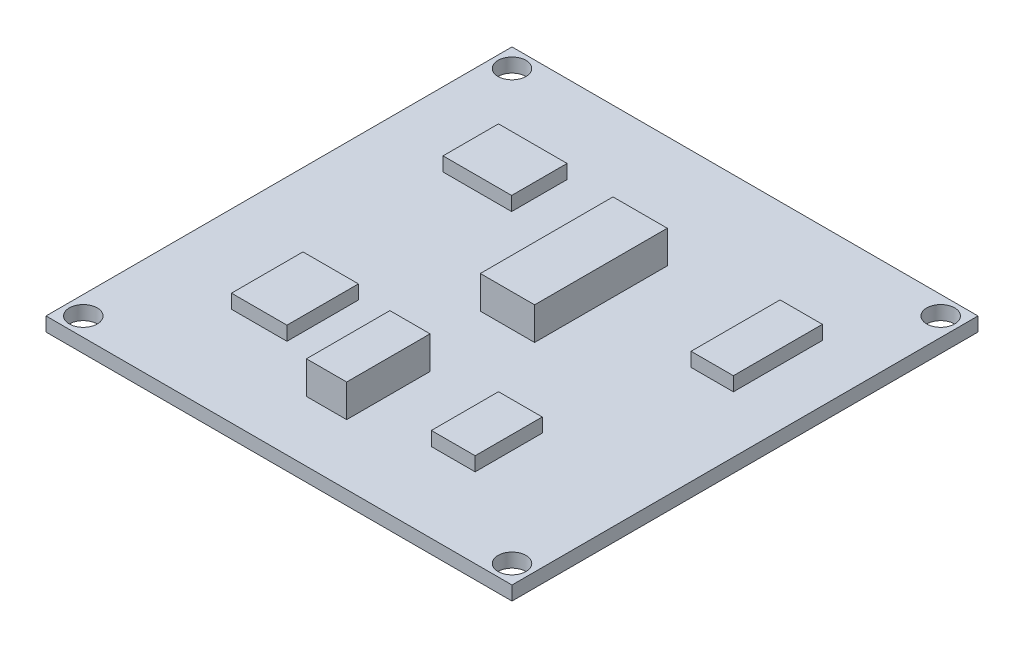
ISO-10303-21;
HEADER;
FILE_DESCRIPTION(('STEP AP214'),'2;1');
FILE_NAME('part.step','',(''),(''),'','','');
FILE_SCHEMA(('AUTOMOTIVE_DESIGN { 1 0 10303 214 1 1 1 1 }'));
ENDSEC;
DATA;
#1=APPLICATION_CONTEXT('core data for automotive mechanical design processes');
#2=APPLICATION_PROTOCOL_DEFINITION('international standard','automotive_design',2000,#1);
#3=PRODUCT_CONTEXT('',#1,'mechanical');
#4=PRODUCT('Part','Part','',(#3));
#5=PRODUCT_RELATED_PRODUCT_CATEGORY('part','',(#4));
#6=PRODUCT_DEFINITION_FORMATION('','',#4);
#7=PRODUCT_DEFINITION_CONTEXT('part definition',#1,'design');
#8=PRODUCT_DEFINITION('design','',#6,#7);
#9=PRODUCT_DEFINITION_SHAPE('','',#8);
#10=(LENGTH_UNIT() NAMED_UNIT(*) SI_UNIT(.MILLI.,.METRE.));
#11=(NAMED_UNIT(*) PLANE_ANGLE_UNIT() SI_UNIT($,.RADIAN.));
#12=(NAMED_UNIT(*) SI_UNIT($,.STERADIAN.) SOLID_ANGLE_UNIT());
#13=UNCERTAINTY_MEASURE_WITH_UNIT(LENGTH_MEASURE(1.E-05),#10,'distance_accuracy_value','');
#14=(GEOMETRIC_REPRESENTATION_CONTEXT(3) GLOBAL_UNCERTAINTY_ASSIGNED_CONTEXT((#13)) GLOBAL_UNIT_ASSIGNED_CONTEXT((#10,
#11,#12)) REPRESENTATION_CONTEXT('',''));
#15=CARTESIAN_POINT('',(0.,0.,0.));
#16=DIRECTION('',(0.,0.,1.));
#17=DIRECTION('',(1.,0.,0.));
#18=AXIS2_PLACEMENT_3D('',#15,#16,#17);
#19=CARTESIAN_POINT('',(0.,-0.900000000000005,0.));
#20=DIRECTION('',(0.,-1.,0.));
#21=DIRECTION('',(0.,0.,-1.));
#22=AXIS2_PLACEMENT_3D('',#19,#20,#21);
#23=PLANE('',#22);
#24=CARTESIAN_POINT('',(23.,-0.900000000000005,-23.));
#25=DIRECTION('',(0.,1.,0.));
#26=DIRECTION('',(0.,0.,1.));
#27=AXIS2_PLACEMENT_3D('',#24,#25,#26);
#28=CIRCLE('',#27,1.5);
#29=CARTESIAN_POINT('',(23.,-0.900000000000005,-21.5));
#30=VERTEX_POINT('',#29);
#31=EDGE_CURVE('E445',#30,#30,#28,.T.);
#32=ORIENTED_EDGE('',*,*,#31,.F.);
#33=EDGE_LOOP('',(#32));
#34=FACE_BOUND('',#33,.T.);
#35=CARTESIAN_POINT('',(-23.,-0.900000000000005,-23.));
#36=DIRECTION('',(0.,1.,0.));
#37=DIRECTION('',(0.,0.,1.));
#38=AXIS2_PLACEMENT_3D('',#35,#36,#37);
#39=CIRCLE('',#38,1.5);
#40=CARTESIAN_POINT('',(-23.,-0.900000000000005,-21.5));
#41=VERTEX_POINT('',#40);
#42=EDGE_CURVE('E476',#41,#41,#39,.T.);
#43=ORIENTED_EDGE('',*,*,#42,.F.);
#44=EDGE_LOOP('',(#43));
#45=FACE_BOUND('',#44,.T.);
#46=CARTESIAN_POINT('',(-23.,-0.900000000000005,23.));
#47=DIRECTION('',(0.,1.,0.));
#48=DIRECTION('',(0.,0.,1.));
#49=AXIS2_PLACEMENT_3D('',#46,#47,#48);
#50=CIRCLE('',#49,1.5);
#51=CARTESIAN_POINT('',(-23.,-0.900000000000005,24.5));
#52=VERTEX_POINT('',#51);
#53=EDGE_CURVE('E473',#52,#52,#50,.T.);
#54=ORIENTED_EDGE('',*,*,#53,.F.);
#55=EDGE_LOOP('',(#54));
#56=FACE_BOUND('',#55,.T.);
#57=CARTESIAN_POINT('',(23.,-0.900000000000005,23.));
#58=DIRECTION('',(0.,1.,0.));
#59=DIRECTION('',(0.,0.,1.));
#60=AXIS2_PLACEMENT_3D('',#57,#58,#59);
#61=CIRCLE('',#60,1.5);
#62=CARTESIAN_POINT('',(23.,-0.900000000000005,24.5));
#63=VERTEX_POINT('',#62);
#64=EDGE_CURVE('E470',#63,#63,#61,.T.);
#65=ORIENTED_EDGE('',*,*,#64,.F.);
#66=EDGE_LOOP('',(#65));
#67=FACE_BOUND('',#66,.T.);
#68=DIRECTION('',(0.,0.,1.));
#69=VECTOR('',#68,1.);
#70=CARTESIAN_POINT('',(-2.14363970085399,-0.900000000000005,-12.9802456876166));
#71=LINE('',#70,#69);
#72=CARTESIAN_POINT('',(-2.14363970085399,-0.900000000000005,-12.9802456876166));
#73=VERTEX_POINT('',#72);
#74=CARTESIAN_POINT('',(-2.14363970085399,-0.900000000000005,1.25468314211257));
#75=VERTEX_POINT('',#74);
#76=EDGE_CURVE('E245',#73,#75,#71,.T.);
#77=ORIENTED_EDGE('',*,*,#76,.F.);
#78=DIRECTION('',(-1.,0.,0.));
#79=VECTOR('',#78,1.);
#80=CARTESIAN_POINT('',(-2.14363970085399,-0.900000000000005,-12.9802456876166));
#81=LINE('',#80,#79);
#82=CARTESIAN_POINT('',(3.67974027494429,-0.900000000000005,-12.9802456876166));
#83=VERTEX_POINT('',#82);
#84=EDGE_CURVE('E258',#83,#73,#81,.T.);
#85=ORIENTED_EDGE('',*,*,#84,.F.);
#86=DIRECTION('',(0.,0.,-1.));
#87=VECTOR('',#86,1.);
#88=CARTESIAN_POINT('',(3.67974027494429,-0.900000000000005,-12.9802456876166));
#89=LINE('',#88,#87);
#90=CARTESIAN_POINT('',(3.67974027494429,-0.900000000000005,1.25468314211257));
#91=VERTEX_POINT('',#90);
#92=EDGE_CURVE('E267',#91,#83,#89,.T.);
#93=ORIENTED_EDGE('',*,*,#92,.F.);
#94=DIRECTION('',(1.,0.,0.));
#95=VECTOR('',#94,1.);
#96=CARTESIAN_POINT('',(-2.14363970085399,-0.900000000000005,1.25468314211257));
#97=LINE('',#96,#95);
#98=EDGE_CURVE('E248',#75,#91,#97,.T.);
#99=ORIENTED_EDGE('',*,*,#98,.F.);
#100=EDGE_LOOP('',(#77,#85,#93,#99));
#101=FACE_BOUND('',#100,.T.);
#102=DIRECTION('',(0.,0.,1.));
#103=VECTOR('',#102,1.);
#104=CARTESIAN_POINT('',(14.3907524121516,-0.900000000000005,-14.3721208625841));
#105=LINE('',#104,#103);
#106=CARTESIAN_POINT('',(14.3907524121516,-0.900000000000005,-14.3721208625841));
#107=VERTEX_POINT('',#106);
#108=CARTESIAN_POINT('',(14.3907524121516,-0.900000000000005,-4.82318405716447));
#109=VERTEX_POINT('',#108);
#110=EDGE_CURVE('E316',#107,#109,#105,.T.);
#111=ORIENTED_EDGE('',*,*,#110,.F.);
#112=DIRECTION('',(-1.,0.,0.));
#113=VECTOR('',#112,1.);
#114=CARTESIAN_POINT('',(14.3907524121516,-0.900000000000005,-14.3721208625841));
#115=LINE('',#114,#113);
#116=CARTESIAN_POINT('',(18.9304108934167,-0.900000000000005,-14.3721208625841));
#117=VERTEX_POINT('',#116);
#118=EDGE_CURVE('E321',#117,#107,#115,.T.);
#119=ORIENTED_EDGE('',*,*,#118,.F.);
#120=DIRECTION('',(0.,0.,-1.));
#121=VECTOR('',#120,1.);
#122=CARTESIAN_POINT('',(18.9304108934167,-0.900000000000005,-14.3721208625841));
#123=LINE('',#122,#121);
#124=CARTESIAN_POINT('',(18.9304108934167,-0.900000000000005,-4.82318405716447));
#125=VERTEX_POINT('',#124);
#126=EDGE_CURVE('E333',#125,#117,#123,.T.);
#127=ORIENTED_EDGE('',*,*,#126,.F.);
#128=DIRECTION('',(1.,0.,0.));
#129=VECTOR('',#128,1.);
#130=CARTESIAN_POINT('',(14.3907524121516,-0.900000000000005,-4.82318405716447));
#131=LINE('',#130,#129);
#132=EDGE_CURVE('E330',#109,#125,#131,.T.);
#133=ORIENTED_EDGE('',*,*,#132,.F.);
#134=EDGE_LOOP('',(#111,#119,#127,#133));
#135=FACE_BOUND('',#134,.T.);
#136=DIRECTION('',(0.,0.,1.));
#137=VECTOR('',#136,1.);
#138=CARTESIAN_POINT('',(-17.0737770614444,-0.900000000000005,-15.6244404436228));
#139=LINE('',#138,#137);
#140=CARTESIAN_POINT('',(-17.0737770614444,-0.900000000000005,-15.6244404436228));
#141=VERTEX_POINT('',#140);
#142=CARTESIAN_POINT('',(-17.0737770614444,-0.900000000000005,-9.67592243368922));
#143=VERTEX_POINT('',#142);
#144=EDGE_CURVE('E382',#141,#143,#139,.T.);
#145=ORIENTED_EDGE('',*,*,#144,.F.);
#146=DIRECTION('',(-1.,0.,0.));
#147=VECTOR('',#146,1.);
#148=CARTESIAN_POINT('',(-17.0737770614444,-0.900000000000005,-15.6244404436228));
#149=LINE('',#148,#147);
#150=CARTESIAN_POINT('',(-9.71639952284237,-0.900000000000005,-15.6244404436228));
#151=VERTEX_POINT('',#150);
#152=EDGE_CURVE('E387',#151,#141,#149,.T.);
#153=ORIENTED_EDGE('',*,*,#152,.F.);
#154=DIRECTION('',(0.,0.,-1.));
#155=VECTOR('',#154,1.);
#156=CARTESIAN_POINT('',(-9.71639952284237,-0.900000000000005,-15.6244404436228));
#157=LINE('',#156,#155);
#158=CARTESIAN_POINT('',(-9.71639952284237,-0.900000000000005,-9.67592243368922));
#159=VERTEX_POINT('',#158);
#160=EDGE_CURVE('E399',#159,#151,#157,.T.);
#161=ORIENTED_EDGE('',*,*,#160,.F.);
#162=DIRECTION('',(1.,0.,0.));
#163=VECTOR('',#162,1.);
#164=CARTESIAN_POINT('',(-17.0737770614444,-0.900000000000005,-9.67592243368922));
#165=LINE('',#164,#163);
#166=EDGE_CURVE('E396',#143,#159,#165,.T.);
#167=ORIENTED_EDGE('',*,*,#166,.F.);
#168=EDGE_LOOP('',(#145,#153,#161,#167));
#169=FACE_BOUND('',#168,.T.);
#170=DIRECTION('',(0.,0.,-1.));
#171=VECTOR('',#170,1.);
#172=CARTESIAN_POINT('',(25.,-0.900000000000005,-25.));
#173=LINE('',#172,#171);
#174=CARTESIAN_POINT('',(25.,-0.900000000000005,25.));
#175=VERTEX_POINT('',#174);
#176=CARTESIAN_POINT('',(25.,-0.900000000000005,-25.));
#177=VERTEX_POINT('',#176);
#178=EDGE_CURVE('E416',#175,#177,#173,.T.);
#179=ORIENTED_EDGE('',*,*,#178,.T.);
#180=DIRECTION('',(-1.,0.,0.));
#181=VECTOR('',#180,1.);
#182=CARTESIAN_POINT('',(25.,-0.900000000000005,-25.));
#183=LINE('',#182,#181);
#184=CARTESIAN_POINT('',(-25.,-0.900000000000005,-25.));
#185=VERTEX_POINT('',#184);
#186=EDGE_CURVE('E419',#177,#185,#183,.T.);
#187=ORIENTED_EDGE('',*,*,#186,.T.);
#188=DIRECTION('',(0.,0.,1.));
#189=VECTOR('',#188,1.);
#190=CARTESIAN_POINT('',(-25.,-0.900000000000005,-25.));
#191=LINE('',#190,#189);
#192=CARTESIAN_POINT('',(-25.,-0.900000000000005,25.));
#193=VERTEX_POINT('',#192);
#194=EDGE_CURVE('E422',#185,#193,#191,.T.);
#195=ORIENTED_EDGE('',*,*,#194,.T.);
#196=DIRECTION('',(1.,0.,0.));
#197=VECTOR('',#196,1.);
#198=CARTESIAN_POINT('',(25.,-0.900000000000005,25.));
#199=LINE('',#198,#197);
#200=EDGE_CURVE('E424',#193,#175,#199,.T.);
#201=ORIENTED_EDGE('',*,*,#200,.T.);
#202=EDGE_LOOP('',(#179,#187,#195,#201));
#203=FACE_BOUND('',#202,.T.);
#204=DIRECTION('',(0.,0.,1.));
#205=VECTOR('',#204,1.);
#206=CARTESIAN_POINT('',(-15.6649175327759,-0.900000000000005,6.76077206744302));
#207=LINE('',#206,#205);
#208=CARTESIAN_POINT('',(-15.6649175327759,-0.900000000000005,6.76077206744302));
#209=VERTEX_POINT('',#208);
#210=CARTESIAN_POINT('',(-15.6649175327759,-0.900000000000005,14.4312295013047));
#211=VERTEX_POINT('',#210);
#212=EDGE_CURVE('E349',#209,#211,#207,.T.);
#213=ORIENTED_EDGE('',*,*,#212,.F.);
#214=DIRECTION('',(-1.,0.,0.));
#215=VECTOR('',#214,1.);
#216=CARTESIAN_POINT('',(-15.6649175327759,-0.900000000000005,6.76077206744302));
#217=LINE('',#216,#215);
#218=CARTESIAN_POINT('',(-9.71639952284237,-0.900000000000005,6.76077206744302));
#219=VERTEX_POINT('',#218);
#220=EDGE_CURVE('E354',#219,#209,#217,.T.);
#221=ORIENTED_EDGE('',*,*,#220,.F.);
#222=DIRECTION('',(0.,0.,-1.));
#223=VECTOR('',#222,1.);
#224=CARTESIAN_POINT('',(-9.71639952284237,-0.900000000000005,6.76077206744302));
#225=LINE('',#224,#223);
#226=CARTESIAN_POINT('',(-9.71639952284237,-0.900000000000005,14.4312295013047));
#227=VERTEX_POINT('',#226);
#228=EDGE_CURVE('E366',#227,#219,#225,.T.);
#229=ORIENTED_EDGE('',*,*,#228,.F.);
#230=DIRECTION('',(1.,0.,0.));
#231=VECTOR('',#230,1.);
#232=CARTESIAN_POINT('',(-15.6649175327759,-0.900000000000005,14.4312295013047));
#233=LINE('',#232,#231);
#234=EDGE_CURVE('E363',#211,#227,#233,.T.);
#235=ORIENTED_EDGE('',*,*,#234,.F.);
#236=EDGE_LOOP('',(#213,#221,#229,#235));
#237=FACE_BOUND('',#236,.T.);
#238=DIRECTION('',(0.,0.,1.));
#239=VECTOR('',#238,1.);
#240=CARTESIAN_POINT('',(7.8160746116987,-0.900000000000005,9.26541122952031));
#241=LINE('',#240,#239);
#242=CARTESIAN_POINT('',(7.8160746116987,-0.900000000000005,9.26541122952031));
#243=VERTEX_POINT('',#242);
#244=CARTESIAN_POINT('',(7.8160746116987,-0.900000000000005,16.4662488204925));
#245=VERTEX_POINT('',#244);
#246=EDGE_CURVE('E283',#243,#245,#241,.T.);
#247=ORIENTED_EDGE('',*,*,#246,.F.);
#248=DIRECTION('',(-1.,0.,0.));
#249=VECTOR('',#248,1.);
#250=CARTESIAN_POINT('',(7.8160746116987,-0.900000000000005,9.26541122952031));
#251=LINE('',#250,#249);
#252=CARTESIAN_POINT('',(12.5122730405936,-0.900000000000005,9.26541122952031));
#253=VERTEX_POINT('',#252);
#254=EDGE_CURVE('E288',#253,#243,#251,.T.);
#255=ORIENTED_EDGE('',*,*,#254,.F.);
#256=DIRECTION('',(0.,0.,-1.));
#257=VECTOR('',#256,1.);
#258=CARTESIAN_POINT('',(12.5122730405936,-0.900000000000005,9.26541122952031));
#259=LINE('',#258,#257);
#260=CARTESIAN_POINT('',(12.5122730405936,-0.900000000000005,16.4662488204925));
#261=VERTEX_POINT('',#260);
#262=EDGE_CURVE('E300',#261,#253,#259,.T.);
#263=ORIENTED_EDGE('',*,*,#262,.F.);
#264=DIRECTION('',(1.,0.,0.));
#265=VECTOR('',#264,1.);
#266=CARTESIAN_POINT('',(7.8160746116987,-0.900000000000005,16.4662488204925));
#267=LINE('',#266,#265);
#268=EDGE_CURVE('E297',#245,#261,#267,.T.);
#269=ORIENTED_EDGE('',*,*,#268,.F.);
#270=EDGE_LOOP('',(#247,#255,#263,#269));
#271=FACE_BOUND('',#270,.T.);
#272=DIRECTION('',(0.,0.,1.));
#273=VECTOR('',#272,1.);
#274=CARTESIAN_POINT('',(-3.54556450984246,-0.900000000000005,9.55839162612124));
#275=LINE('',#274,#273);
#276=CARTESIAN_POINT('',(-3.54556450984246,-0.900000000000005,9.55839162612124));
#277=VERTEX_POINT('',#276);
#278=CARTESIAN_POINT('',(-3.54556450984246,-0.900000000000005,18.509142329663));
#279=VERTEX_POINT('',#278);
#280=EDGE_CURVE('E244',#277,#279,#275,.T.);
#281=ORIENTED_EDGE('',*,*,#280,.F.);
#282=DIRECTION('',(-1.,0.,0.));
#283=VECTOR('',#282,1.);
#284=CARTESIAN_POINT('',(-3.54556450984246,-0.900000000000005,9.55839162612124));
#285=LINE('',#284,#283);
#286=CARTESIAN_POINT('',(0.768050287045151,-0.900000000000005,9.55839162612124));
#287=VERTEX_POINT('',#286);
#288=EDGE_CURVE('E241',#287,#277,#285,.T.);
#289=ORIENTED_EDGE('',*,*,#288,.F.);
#290=DIRECTION('',(0.,0.,-1.));
#291=VECTOR('',#290,1.);
#292=CARTESIAN_POINT('',(0.768050287045151,-0.900000000000005,9.55839162612124));
#293=LINE('',#292,#291);
#294=CARTESIAN_POINT('',(0.768050287045151,-0.900000000000005,18.509142329663));
#295=VERTEX_POINT('',#294);
#296=EDGE_CURVE('E59',#295,#287,#293,.T.);
#297=ORIENTED_EDGE('',*,*,#296,.F.);
#298=DIRECTION('',(1.,0.,0.));
#299=VECTOR('',#298,1.);
#300=CARTESIAN_POINT('',(-3.54556450984246,-0.900000000000005,18.509142329663));
#301=LINE('',#300,#299);
#302=EDGE_CURVE('E54',#279,#295,#301,.T.);
#303=ORIENTED_EDGE('',*,*,#302,.F.);
#304=EDGE_LOOP('',(#281,#289,#297,#303));
#305=FACE_BOUND('',#304,.T.);
#306=ADVANCED_FACE('F37',(#34,#45,#56,#67,#101,#135,#169,#203,#237,#271,#305),#23,.F.);
#307=CARTESIAN_POINT('',(25.,-0.900000000000005,-25.));
#308=DIRECTION('',(-1.,0.,0.));
#309=DIRECTION('',(0.,0.,1.));
#310=AXIS2_PLACEMENT_3D('',#307,#308,#309);
#311=PLANE('',#310);
#312=DIRECTION('',(0.,0.,-1.));
#313=VECTOR('',#312,1.);
#314=CARTESIAN_POINT('',(25.,-2.4,-25.));
#315=LINE('',#314,#313);
#316=CARTESIAN_POINT('',(25.,-2.4,25.));
#317=VERTEX_POINT('',#316);
#318=CARTESIAN_POINT('',(25.,-2.4,-25.));
#319=VERTEX_POINT('',#318);
#320=EDGE_CURVE('E415',#317,#319,#315,.T.);
#321=ORIENTED_EDGE('',*,*,#320,.T.);
#322=DIRECTION('',(0.,-1.,0.));
#323=VECTOR('',#322,1.);
#324=CARTESIAN_POINT('',(25.,-0.900000000000005,-25.));
#325=LINE('',#324,#323);
#326=EDGE_CURVE('E11',#177,#319,#325,.T.);
#327=ORIENTED_EDGE('',*,*,#326,.F.);
#328=ORIENTED_EDGE('',*,*,#178,.F.);
#329=DIRECTION('',(0.,-1.,0.));
#330=VECTOR('',#329,1.);
#331=CARTESIAN_POINT('',(25.,-0.900000000000005,25.));
#332=LINE('',#331,#330);
#333=EDGE_CURVE('E426',#175,#317,#332,.T.);
#334=ORIENTED_EDGE('',*,*,#333,.T.);
#335=EDGE_LOOP('',(#321,#327,#328,#334));
#336=FACE_BOUND('',#335,.T.);
#337=ADVANCED_FACE('F39',(#336),#311,.F.);
#338=CARTESIAN_POINT('',(25.,-0.900000000000005,-25.));
#339=DIRECTION('',(0.,0.,1.));
#340=DIRECTION('',(1.,0.,0.));
#341=AXIS2_PLACEMENT_3D('',#338,#339,#340);
#342=PLANE('',#341);
#343=DIRECTION('',(-1.,0.,0.));
#344=VECTOR('',#343,1.);
#345=CARTESIAN_POINT('',(25.,-2.4,-25.));
#346=LINE('',#345,#344);
#347=CARTESIAN_POINT('',(-25.,-2.4,-25.));
#348=VERTEX_POINT('',#347);
#349=EDGE_CURVE('E429',#319,#348,#346,.T.);
#350=ORIENTED_EDGE('',*,*,#349,.T.);
#351=DIRECTION('',(0.,-1.,0.));
#352=VECTOR('',#351,1.);
#353=CARTESIAN_POINT('',(-25.,-0.900000000000005,-25.));
#354=LINE('',#353,#352);
#355=EDGE_CURVE('E46',#185,#348,#354,.T.);
#356=ORIENTED_EDGE('',*,*,#355,.F.);
#357=ORIENTED_EDGE('',*,*,#186,.F.);
#358=ORIENTED_EDGE('',*,*,#326,.T.);
#359=EDGE_LOOP('',(#350,#356,#357,#358));
#360=FACE_BOUND('',#359,.T.);
#361=ADVANCED_FACE('F597',(#360),#342,.F.);
#362=CARTESIAN_POINT('',(-25.,-0.900000000000005,-25.));
#363=DIRECTION('',(1.,0.,0.));
#364=DIRECTION('',(0.,0.,-1.));
#365=AXIS2_PLACEMENT_3D('',#362,#363,#364);
#366=PLANE('',#365);
#367=DIRECTION('',(0.,0.,1.));
#368=VECTOR('',#367,1.);
#369=CARTESIAN_POINT('',(-25.,-2.4,-25.));
#370=LINE('',#369,#368);
#371=CARTESIAN_POINT('',(-25.,-2.4,25.));
#372=VERTEX_POINT('',#371);
#373=EDGE_CURVE('E431',#348,#372,#370,.T.);
#374=ORIENTED_EDGE('',*,*,#373,.T.);
#375=DIRECTION('',(0.,-1.,0.));
#376=VECTOR('',#375,1.);
#377=CARTESIAN_POINT('',(-25.,-0.900000000000005,25.));
#378=LINE('',#377,#376);
#379=EDGE_CURVE('E436',#193,#372,#378,.T.);
#380=ORIENTED_EDGE('',*,*,#379,.F.);
#381=ORIENTED_EDGE('',*,*,#194,.F.);
#382=ORIENTED_EDGE('',*,*,#355,.T.);
#383=EDGE_LOOP('',(#374,#380,#381,#382));
#384=FACE_BOUND('',#383,.T.);
#385=ADVANCED_FACE('F594',(#384),#366,.F.);
#386=CARTESIAN_POINT('',(25.,-0.900000000000005,25.));
#387=DIRECTION('',(0.,0.,-1.));
#388=DIRECTION('',(-1.,0.,0.));
#389=AXIS2_PLACEMENT_3D('',#386,#387,#388);
#390=PLANE('',#389);
#391=DIRECTION('',(1.,0.,0.));
#392=VECTOR('',#391,1.);
#393=CARTESIAN_POINT('',(25.,-2.4,25.));
#394=LINE('',#393,#392);
#395=EDGE_CURVE('E420',#372,#317,#394,.T.);
#396=ORIENTED_EDGE('',*,*,#395,.T.);
#397=ORIENTED_EDGE('',*,*,#333,.F.);
#398=ORIENTED_EDGE('',*,*,#200,.F.);
#399=ORIENTED_EDGE('',*,*,#379,.T.);
#400=EDGE_LOOP('',(#396,#397,#398,#399));
#401=FACE_BOUND('',#400,.T.);
#402=ADVANCED_FACE('F590',(#401),#390,.F.);
#403=CARTESIAN_POINT('',(0.,-2.4,0.));
#404=DIRECTION('',(0.,-1.,0.));
#405=DIRECTION('',(0.,0.,-1.));
#406=AXIS2_PLACEMENT_3D('',#403,#404,#405);
#407=PLANE('',#406);
#408=CARTESIAN_POINT('',(23.,-2.4,-23.));
#409=DIRECTION('',(0.,-1.,0.));
#410=DIRECTION('',(0.,0.,-1.));
#411=AXIS2_PLACEMENT_3D('',#408,#409,#410);
#412=CIRCLE('',#411,1.5);
#413=CARTESIAN_POINT('',(23.,-2.4,-24.5));
#414=VERTEX_POINT('',#413);
#415=EDGE_CURVE('E41',#414,#414,#412,.T.);
#416=ORIENTED_EDGE('',*,*,#415,.F.);
#417=EDGE_LOOP('',(#416));
#418=FACE_BOUND('',#417,.T.);
#419=CARTESIAN_POINT('',(-23.,-2.4,-23.));
#420=DIRECTION('',(0.,-1.,0.));
#421=DIRECTION('',(0.,0.,-1.));
#422=AXIS2_PLACEMENT_3D('',#419,#420,#421);
#423=CIRCLE('',#422,1.5);
#424=CARTESIAN_POINT('',(-23.,-2.4,-24.5));
#425=VERTEX_POINT('',#424);
#426=EDGE_CURVE('E447',#425,#425,#423,.T.);
#427=ORIENTED_EDGE('',*,*,#426,.F.);
#428=EDGE_LOOP('',(#427));
#429=FACE_BOUND('',#428,.T.);
#430=CARTESIAN_POINT('',(-23.,-2.4,23.));
#431=DIRECTION('',(0.,-1.,0.));
#432=DIRECTION('',(0.,0.,-1.));
#433=AXIS2_PLACEMENT_3D('',#430,#431,#432);
#434=CIRCLE('',#433,1.5);
#435=CARTESIAN_POINT('',(-23.,-2.4,21.5));
#436=VERTEX_POINT('',#435);
#437=EDGE_CURVE('E444',#436,#436,#434,.T.);
#438=ORIENTED_EDGE('',*,*,#437,.F.);
#439=EDGE_LOOP('',(#438));
#440=FACE_BOUND('',#439,.T.);
#441=CARTESIAN_POINT('',(23.,-2.4,23.));
#442=DIRECTION('',(0.,-1.,0.));
#443=DIRECTION('',(0.,0.,-1.));
#444=AXIS2_PLACEMENT_3D('',#441,#442,#443);
#445=CIRCLE('',#444,1.5);
#446=CARTESIAN_POINT('',(23.,-2.4,21.5));
#447=VERTEX_POINT('',#446);
#448=EDGE_CURVE('E441',#447,#447,#445,.T.);
#449=ORIENTED_EDGE('',*,*,#448,.F.);
#450=EDGE_LOOP('',(#449));
#451=FACE_BOUND('',#450,.T.);
#452=ORIENTED_EDGE('',*,*,#320,.F.);
#453=ORIENTED_EDGE('',*,*,#395,.F.);
#454=ORIENTED_EDGE('',*,*,#373,.F.);
#455=ORIENTED_EDGE('',*,*,#349,.F.);
#456=EDGE_LOOP('',(#452,#453,#454,#455));
#457=FACE_BOUND('',#456,.T.);
#458=ADVANCED_FACE('F585',(#418,#429,#440,#451,#457),#407,.T.);
#459=CARTESIAN_POINT('',(-17.0737770614444,0.599999999999996,-15.6244404436228));
#460=DIRECTION('',(1.,0.,0.));
#461=DIRECTION('',(0.,0.,-1.));
#462=AXIS2_PLACEMENT_3D('',#459,#460,#461);
#463=PLANE('',#462);
#464=ORIENTED_EDGE('',*,*,#144,.T.);
#465=DIRECTION('',(0.,-1.,0.));
#466=VECTOR('',#465,1.);
#467=CARTESIAN_POINT('',(-17.0737770614444,0.599999999999996,-9.67592243368922));
#468=LINE('',#467,#466);
#469=CARTESIAN_POINT('',(-17.0737770614444,0.599999999999996,-9.67592243368922));
#470=VERTEX_POINT('',#469);
#471=EDGE_CURVE('E412',#470,#143,#468,.T.);
#472=ORIENTED_EDGE('',*,*,#471,.F.);
#473=DIRECTION('',(0.,0.,1.));
#474=VECTOR('',#473,1.);
#475=CARTESIAN_POINT('',(-17.0737770614444,0.599999999999996,-15.6244404436228));
#476=LINE('',#475,#474);
#477=CARTESIAN_POINT('',(-17.0737770614444,0.599999999999996,-15.6244404436228));
#478=VERTEX_POINT('',#477);
#479=EDGE_CURVE('E383',#478,#470,#476,.T.);
#480=ORIENTED_EDGE('',*,*,#479,.F.);
#481=DIRECTION('',(0.,-1.,0.));
#482=VECTOR('',#481,1.);
#483=CARTESIAN_POINT('',(-17.0737770614444,0.599999999999996,-15.6244404436228));
#484=LINE('',#483,#482);
#485=EDGE_CURVE('E393',#478,#141,#484,.T.);
#486=ORIENTED_EDGE('',*,*,#485,.T.);
#487=EDGE_LOOP('',(#464,#472,#480,#486));
#488=FACE_BOUND('',#487,.T.);
#489=ADVANCED_FACE('F582',(#488),#463,.F.);
#490=CARTESIAN_POINT('',(-17.0737770614444,0.599999999999996,-9.67592243368922));
#491=DIRECTION('',(0.,0.,-1.));
#492=DIRECTION('',(-1.,0.,0.));
#493=AXIS2_PLACEMENT_3D('',#490,#491,#492);
#494=PLANE('',#493);
#495=ORIENTED_EDGE('',*,*,#166,.T.);
#496=DIRECTION('',(0.,-1.,0.));
#497=VECTOR('',#496,1.);
#498=CARTESIAN_POINT('',(-9.71639952284237,0.599999999999996,-9.67592243368922));
#499=LINE('',#498,#497);
#500=CARTESIAN_POINT('',(-9.71639952284237,0.599999999999996,-9.67592243368922));
#501=VERTEX_POINT('',#500);
#502=EDGE_CURVE('E409',#501,#159,#499,.T.);
#503=ORIENTED_EDGE('',*,*,#502,.F.);
#504=DIRECTION('',(1.,0.,0.));
#505=VECTOR('',#504,1.);
#506=CARTESIAN_POINT('',(-17.0737770614444,0.599999999999996,-9.67592243368922));
#507=LINE('',#506,#505);
#508=EDGE_CURVE('E386',#470,#501,#507,.T.);
#509=ORIENTED_EDGE('',*,*,#508,.F.);
#510=ORIENTED_EDGE('',*,*,#471,.T.);
#511=EDGE_LOOP('',(#495,#503,#509,#510));
#512=FACE_BOUND('',#511,.T.);
#513=ADVANCED_FACE('F578',(#512),#494,.F.);
#514=CARTESIAN_POINT('',(-9.71639952284237,0.599999999999996,-15.6244404436228));
#515=DIRECTION('',(-1.,0.,0.));
#516=DIRECTION('',(0.,0.,1.));
#517=AXIS2_PLACEMENT_3D('',#514,#515,#516);
#518=PLANE('',#517);
#519=ORIENTED_EDGE('',*,*,#160,.T.);
#520=DIRECTION('',(0.,-1.,0.));
#521=VECTOR('',#520,1.);
#522=CARTESIAN_POINT('',(-9.71639952284237,0.599999999999996,-15.6244404436228));
#523=LINE('',#522,#521);
#524=CARTESIAN_POINT('',(-9.71639952284237,0.599999999999996,-15.6244404436228));
#525=VERTEX_POINT('',#524);
#526=EDGE_CURVE('E406',#525,#151,#523,.T.);
#527=ORIENTED_EDGE('',*,*,#526,.F.);
#528=DIRECTION('',(0.,0.,-1.));
#529=VECTOR('',#528,1.);
#530=CARTESIAN_POINT('',(-9.71639952284237,0.599999999999996,-15.6244404436228));
#531=LINE('',#530,#529);
#532=EDGE_CURVE('E389',#501,#525,#531,.T.);
#533=ORIENTED_EDGE('',*,*,#532,.F.);
#534=ORIENTED_EDGE('',*,*,#502,.T.);
#535=EDGE_LOOP('',(#519,#527,#533,#534));
#536=FACE_BOUND('',#535,.T.);
#537=ADVANCED_FACE('F574',(#536),#518,.F.);
#538=CARTESIAN_POINT('',(-17.0737770614444,0.599999999999996,-15.6244404436228));
#539=DIRECTION('',(0.,0.,1.));
#540=DIRECTION('',(1.,0.,0.));
#541=AXIS2_PLACEMENT_3D('',#538,#539,#540);
#542=PLANE('',#541);
#543=ORIENTED_EDGE('',*,*,#152,.T.);
#544=ORIENTED_EDGE('',*,*,#485,.F.);
#545=DIRECTION('',(-1.,0.,0.));
#546=VECTOR('',#545,1.);
#547=CARTESIAN_POINT('',(-17.0737770614444,0.599999999999996,-15.6244404436228));
#548=LINE('',#547,#546);
#549=EDGE_CURVE('E391',#525,#478,#548,.T.);
#550=ORIENTED_EDGE('',*,*,#549,.F.);
#551=ORIENTED_EDGE('',*,*,#526,.T.);
#552=EDGE_LOOP('',(#543,#544,#550,#551));
#553=FACE_BOUND('',#552,.T.);
#554=ADVANCED_FACE('F570',(#553),#542,.F.);
#555=CARTESIAN_POINT('',(0.,0.599999999999996,0.));
#556=DIRECTION('',(0.,1.,0.));
#557=DIRECTION('',(0.,0.,1.));
#558=AXIS2_PLACEMENT_3D('',#555,#556,#557);
#559=PLANE('',#558);
#560=ORIENTED_EDGE('',*,*,#479,.T.);
#561=ORIENTED_EDGE('',*,*,#508,.T.);
#562=ORIENTED_EDGE('',*,*,#532,.T.);
#563=ORIENTED_EDGE('',*,*,#549,.T.);
#564=EDGE_LOOP('',(#560,#561,#562,#563));
#565=FACE_BOUND('',#564,.T.);
#566=ADVANCED_FACE('F566',(#565),#559,.T.);
#567=CARTESIAN_POINT('',(-15.6649175327759,0.599999999999996,6.76077206744302));
#568=DIRECTION('',(1.,0.,0.));
#569=DIRECTION('',(0.,0.,-1.));
#570=AXIS2_PLACEMENT_3D('',#567,#568,#569);
#571=PLANE('',#570);
#572=ORIENTED_EDGE('',*,*,#212,.T.);
#573=DIRECTION('',(0.,-1.,0.));
#574=VECTOR('',#573,1.);
#575=CARTESIAN_POINT('',(-15.6649175327759,0.599999999999996,14.4312295013047));
#576=LINE('',#575,#574);
#577=CARTESIAN_POINT('',(-15.6649175327759,0.599999999999996,14.4312295013047));
#578=VERTEX_POINT('',#577);
#579=EDGE_CURVE('E379',#578,#211,#576,.T.);
#580=ORIENTED_EDGE('',*,*,#579,.F.);
#581=DIRECTION('',(0.,0.,1.));
#582=VECTOR('',#581,1.);
#583=CARTESIAN_POINT('',(-15.6649175327759,0.599999999999996,6.76077206744302));
#584=LINE('',#583,#582);
#585=CARTESIAN_POINT('',(-15.6649175327759,0.599999999999996,6.76077206744302));
#586=VERTEX_POINT('',#585);
#587=EDGE_CURVE('E350',#586,#578,#584,.T.);
#588=ORIENTED_EDGE('',*,*,#587,.F.);
#589=DIRECTION('',(0.,-1.,0.));
#590=VECTOR('',#589,1.);
#591=CARTESIAN_POINT('',(-15.6649175327759,0.599999999999996,6.76077206744302));
#592=LINE('',#591,#590);
#593=EDGE_CURVE('E360',#586,#209,#592,.T.);
#594=ORIENTED_EDGE('',*,*,#593,.T.);
#595=EDGE_LOOP('',(#572,#580,#588,#594));
#596=FACE_BOUND('',#595,.T.);
#597=ADVANCED_FACE('F562',(#596),#571,.F.);
#598=CARTESIAN_POINT('',(-15.6649175327759,0.599999999999996,14.4312295013047));
#599=DIRECTION('',(0.,0.,-1.));
#600=DIRECTION('',(-1.,0.,0.));
#601=AXIS2_PLACEMENT_3D('',#598,#599,#600);
#602=PLANE('',#601);
#603=ORIENTED_EDGE('',*,*,#234,.T.);
#604=DIRECTION('',(0.,-1.,0.));
#605=VECTOR('',#604,1.);
#606=CARTESIAN_POINT('',(-9.71639952284237,0.599999999999996,14.4312295013047));
#607=LINE('',#606,#605);
#608=CARTESIAN_POINT('',(-9.71639952284237,0.599999999999996,14.4312295013047));
#609=VERTEX_POINT('',#608);
#610=EDGE_CURVE('E376',#609,#227,#607,.T.);
#611=ORIENTED_EDGE('',*,*,#610,.F.);
#612=DIRECTION('',(1.,0.,0.));
#613=VECTOR('',#612,1.);
#614=CARTESIAN_POINT('',(-15.6649175327759,0.599999999999996,14.4312295013047));
#615=LINE('',#614,#613);
#616=EDGE_CURVE('E353',#578,#609,#615,.T.);
#617=ORIENTED_EDGE('',*,*,#616,.F.);
#618=ORIENTED_EDGE('',*,*,#579,.T.);
#619=EDGE_LOOP('',(#603,#611,#617,#618));
#620=FACE_BOUND('',#619,.T.);
#621=ADVANCED_FACE('F558',(#620),#602,.F.);
#622=CARTESIAN_POINT('',(-9.71639952284237,0.599999999999996,6.76077206744302));
#623=DIRECTION('',(-1.,0.,0.));
#624=DIRECTION('',(0.,0.,1.));
#625=AXIS2_PLACEMENT_3D('',#622,#623,#624);
#626=PLANE('',#625);
#627=ORIENTED_EDGE('',*,*,#228,.T.);
#628=DIRECTION('',(0.,-1.,0.));
#629=VECTOR('',#628,1.);
#630=CARTESIAN_POINT('',(-9.71639952284237,0.599999999999996,6.76077206744302));
#631=LINE('',#630,#629);
#632=CARTESIAN_POINT('',(-9.71639952284237,0.599999999999996,6.76077206744302));
#633=VERTEX_POINT('',#632);
#634=EDGE_CURVE('E373',#633,#219,#631,.T.);
#635=ORIENTED_EDGE('',*,*,#634,.F.);
#636=DIRECTION('',(0.,0.,-1.));
#637=VECTOR('',#636,1.);
#638=CARTESIAN_POINT('',(-9.71639952284237,0.599999999999996,6.76077206744302));
#639=LINE('',#638,#637);
#640=EDGE_CURVE('E356',#609,#633,#639,.T.);
#641=ORIENTED_EDGE('',*,*,#640,.F.);
#642=ORIENTED_EDGE('',*,*,#610,.T.);
#643=EDGE_LOOP('',(#627,#635,#641,#642));
#644=FACE_BOUND('',#643,.T.);
#645=ADVANCED_FACE('F554',(#644),#626,.F.);
#646=CARTESIAN_POINT('',(-15.6649175327759,0.599999999999996,6.76077206744302));
#647=DIRECTION('',(0.,0.,1.));
#648=DIRECTION('',(1.,0.,0.));
#649=AXIS2_PLACEMENT_3D('',#646,#647,#648);
#650=PLANE('',#649);
#651=ORIENTED_EDGE('',*,*,#220,.T.);
#652=ORIENTED_EDGE('',*,*,#593,.F.);
#653=DIRECTION('',(-1.,0.,0.));
#654=VECTOR('',#653,1.);
#655=CARTESIAN_POINT('',(-15.6649175327759,0.599999999999996,6.76077206744302));
#656=LINE('',#655,#654);
#657=EDGE_CURVE('E358',#633,#586,#656,.T.);
#658=ORIENTED_EDGE('',*,*,#657,.F.);
#659=ORIENTED_EDGE('',*,*,#634,.T.);
#660=EDGE_LOOP('',(#651,#652,#658,#659));
#661=FACE_BOUND('',#660,.T.);
#662=ADVANCED_FACE('F550',(#661),#650,.F.);
#663=CARTESIAN_POINT('',(0.,0.599999999999996,0.));
#664=DIRECTION('',(0.,1.,0.));
#665=DIRECTION('',(0.,0.,1.));
#666=AXIS2_PLACEMENT_3D('',#663,#664,#665);
#667=PLANE('',#666);
#668=ORIENTED_EDGE('',*,*,#587,.T.);
#669=ORIENTED_EDGE('',*,*,#616,.T.);
#670=ORIENTED_EDGE('',*,*,#640,.T.);
#671=ORIENTED_EDGE('',*,*,#657,.T.);
#672=EDGE_LOOP('',(#668,#669,#670,#671));
#673=FACE_BOUND('',#672,.T.);
#674=ADVANCED_FACE('F546',(#673),#667,.T.);
#675=CARTESIAN_POINT('',(14.3907524121516,0.599999999999996,-14.3721208625841));
#676=DIRECTION('',(1.,0.,0.));
#677=DIRECTION('',(0.,0.,-1.));
#678=AXIS2_PLACEMENT_3D('',#675,#676,#677);
#679=PLANE('',#678);
#680=ORIENTED_EDGE('',*,*,#110,.T.);
#681=DIRECTION('',(0.,-1.,0.));
#682=VECTOR('',#681,1.);
#683=CARTESIAN_POINT('',(14.3907524121516,0.599999999999996,-4.82318405716447));
#684=LINE('',#683,#682);
#685=CARTESIAN_POINT('',(14.3907524121516,0.599999999999996,-4.82318405716447));
#686=VERTEX_POINT('',#685);
#687=EDGE_CURVE('E346',#686,#109,#684,.T.);
#688=ORIENTED_EDGE('',*,*,#687,.F.);
#689=DIRECTION('',(0.,0.,1.));
#690=VECTOR('',#689,1.);
#691=CARTESIAN_POINT('',(14.3907524121516,0.599999999999996,-14.3721208625841));
#692=LINE('',#691,#690);
#693=CARTESIAN_POINT('',(14.3907524121516,0.599999999999996,-14.3721208625841));
#694=VERTEX_POINT('',#693);
#695=EDGE_CURVE('E317',#694,#686,#692,.T.);
#696=ORIENTED_EDGE('',*,*,#695,.F.);
#697=DIRECTION('',(0.,-1.,0.));
#698=VECTOR('',#697,1.);
#699=CARTESIAN_POINT('',(14.3907524121516,0.599999999999996,-14.3721208625841));
#700=LINE('',#699,#698);
#701=EDGE_CURVE('E327',#694,#107,#700,.T.);
#702=ORIENTED_EDGE('',*,*,#701,.T.);
#703=EDGE_LOOP('',(#680,#688,#696,#702));
#704=FACE_BOUND('',#703,.T.);
#705=ADVANCED_FACE('F542',(#704),#679,.F.);
#706=CARTESIAN_POINT('',(14.3907524121516,0.599999999999996,-4.82318405716447));
#707=DIRECTION('',(0.,0.,-1.));
#708=DIRECTION('',(-1.,0.,0.));
#709=AXIS2_PLACEMENT_3D('',#706,#707,#708);
#710=PLANE('',#709);
#711=ORIENTED_EDGE('',*,*,#132,.T.);
#712=DIRECTION('',(0.,-1.,0.));
#713=VECTOR('',#712,1.);
#714=CARTESIAN_POINT('',(18.9304108934167,0.599999999999996,-4.82318405716447));
#715=LINE('',#714,#713);
#716=CARTESIAN_POINT('',(18.9304108934167,0.599999999999996,-4.82318405716447));
#717=VERTEX_POINT('',#716);
#718=EDGE_CURVE('E343',#717,#125,#715,.T.);
#719=ORIENTED_EDGE('',*,*,#718,.F.);
#720=DIRECTION('',(1.,0.,0.));
#721=VECTOR('',#720,1.);
#722=CARTESIAN_POINT('',(14.3907524121516,0.599999999999996,-4.82318405716447));
#723=LINE('',#722,#721);
#724=EDGE_CURVE('E320',#686,#717,#723,.T.);
#725=ORIENTED_EDGE('',*,*,#724,.F.);
#726=ORIENTED_EDGE('',*,*,#687,.T.);
#727=EDGE_LOOP('',(#711,#719,#725,#726));
#728=FACE_BOUND('',#727,.T.);
#729=ADVANCED_FACE('F538',(#728),#710,.F.);
#730=CARTESIAN_POINT('',(18.9304108934167,0.599999999999996,-14.3721208625841));
#731=DIRECTION('',(-1.,0.,0.));
#732=DIRECTION('',(0.,0.,1.));
#733=AXIS2_PLACEMENT_3D('',#730,#731,#732);
#734=PLANE('',#733);
#735=ORIENTED_EDGE('',*,*,#126,.T.);
#736=DIRECTION('',(0.,-1.,0.));
#737=VECTOR('',#736,1.);
#738=CARTESIAN_POINT('',(18.9304108934167,0.599999999999996,-14.3721208625841));
#739=LINE('',#738,#737);
#740=CARTESIAN_POINT('',(18.9304108934167,0.599999999999996,-14.3721208625841));
#741=VERTEX_POINT('',#740);
#742=EDGE_CURVE('E340',#741,#117,#739,.T.);
#743=ORIENTED_EDGE('',*,*,#742,.F.);
#744=DIRECTION('',(0.,0.,-1.));
#745=VECTOR('',#744,1.);
#746=CARTESIAN_POINT('',(18.9304108934167,0.599999999999996,-14.3721208625841));
#747=LINE('',#746,#745);
#748=EDGE_CURVE('E323',#717,#741,#747,.T.);
#749=ORIENTED_EDGE('',*,*,#748,.F.);
#750=ORIENTED_EDGE('',*,*,#718,.T.);
#751=EDGE_LOOP('',(#735,#743,#749,#750));
#752=FACE_BOUND('',#751,.T.);
#753=ADVANCED_FACE('F534',(#752),#734,.F.);
#754=CARTESIAN_POINT('',(14.3907524121516,0.599999999999996,-14.3721208625841));
#755=DIRECTION('',(0.,0.,1.));
#756=DIRECTION('',(1.,0.,0.));
#757=AXIS2_PLACEMENT_3D('',#754,#755,#756);
#758=PLANE('',#757);
#759=ORIENTED_EDGE('',*,*,#118,.T.);
#760=ORIENTED_EDGE('',*,*,#701,.F.);
#761=DIRECTION('',(-1.,0.,0.));
#762=VECTOR('',#761,1.);
#763=CARTESIAN_POINT('',(14.3907524121516,0.599999999999996,-14.3721208625841));
#764=LINE('',#763,#762);
#765=EDGE_CURVE('E325',#741,#694,#764,.T.);
#766=ORIENTED_EDGE('',*,*,#765,.F.);
#767=ORIENTED_EDGE('',*,*,#742,.T.);
#768=EDGE_LOOP('',(#759,#760,#766,#767));
#769=FACE_BOUND('',#768,.T.);
#770=ADVANCED_FACE('F530',(#769),#758,.F.);
#771=CARTESIAN_POINT('',(0.,0.599999999999996,0.));
#772=DIRECTION('',(0.,1.,0.));
#773=DIRECTION('',(0.,0.,1.));
#774=AXIS2_PLACEMENT_3D('',#771,#772,#773);
#775=PLANE('',#774);
#776=ORIENTED_EDGE('',*,*,#695,.T.);
#777=ORIENTED_EDGE('',*,*,#724,.T.);
#778=ORIENTED_EDGE('',*,*,#748,.T.);
#779=ORIENTED_EDGE('',*,*,#765,.T.);
#780=EDGE_LOOP('',(#776,#777,#778,#779));
#781=FACE_BOUND('',#780,.T.);
#782=ADVANCED_FACE('F524',(#781),#775,.T.);
#783=CARTESIAN_POINT('',(7.8160746116987,0.599999999999996,9.26541122952031));
#784=DIRECTION('',(1.,0.,0.));
#785=DIRECTION('',(0.,0.,-1.));
#786=AXIS2_PLACEMENT_3D('',#783,#784,#785);
#787=PLANE('',#786);
#788=ORIENTED_EDGE('',*,*,#246,.T.);
#789=DIRECTION('',(0.,-1.,0.));
#790=VECTOR('',#789,1.);
#791=CARTESIAN_POINT('',(7.8160746116987,0.599999999999996,16.4662488204925));
#792=LINE('',#791,#790);
#793=CARTESIAN_POINT('',(7.8160746116987,0.599999999999996,16.4662488204925));
#794=VERTEX_POINT('',#793);
#795=EDGE_CURVE('E313',#794,#245,#792,.T.);
#796=ORIENTED_EDGE('',*,*,#795,.F.);
#797=DIRECTION('',(0.,0.,1.));
#798=VECTOR('',#797,1.);
#799=CARTESIAN_POINT('',(7.8160746116987,0.599999999999996,9.26541122952031));
#800=LINE('',#799,#798);
#801=CARTESIAN_POINT('',(7.8160746116987,0.599999999999996,9.26541122952031));
#802=VERTEX_POINT('',#801);
#803=EDGE_CURVE('E284',#802,#794,#800,.T.);
#804=ORIENTED_EDGE('',*,*,#803,.F.);
#805=DIRECTION('',(0.,-1.,0.));
#806=VECTOR('',#805,1.);
#807=CARTESIAN_POINT('',(7.8160746116987,0.599999999999996,9.26541122952031));
#808=LINE('',#807,#806);
#809=EDGE_CURVE('E294',#802,#243,#808,.T.);
#810=ORIENTED_EDGE('',*,*,#809,.T.);
#811=EDGE_LOOP('',(#788,#796,#804,#810));
#812=FACE_BOUND('',#811,.T.);
#813=ADVANCED_FACE('F508',(#812),#787,.F.);
#814=CARTESIAN_POINT('',(7.8160746116987,0.599999999999996,16.4662488204925));
#815=DIRECTION('',(0.,0.,-1.));
#816=DIRECTION('',(-1.,0.,0.));
#817=AXIS2_PLACEMENT_3D('',#814,#815,#816);
#818=PLANE('',#817);
#819=ORIENTED_EDGE('',*,*,#268,.T.);
#820=DIRECTION('',(0.,-1.,0.));
#821=VECTOR('',#820,1.);
#822=CARTESIAN_POINT('',(12.5122730405936,0.599999999999996,16.4662488204925));
#823=LINE('',#822,#821);
#824=CARTESIAN_POINT('',(12.5122730405936,0.599999999999996,16.4662488204925));
#825=VERTEX_POINT('',#824);
#826=EDGE_CURVE('E310',#825,#261,#823,.T.);
#827=ORIENTED_EDGE('',*,*,#826,.F.);
#828=DIRECTION('',(1.,0.,0.));
#829=VECTOR('',#828,1.);
#830=CARTESIAN_POINT('',(7.8160746116987,0.599999999999996,16.4662488204925));
#831=LINE('',#830,#829);
#832=EDGE_CURVE('E287',#794,#825,#831,.T.);
#833=ORIENTED_EDGE('',*,*,#832,.F.);
#834=ORIENTED_EDGE('',*,*,#795,.T.);
#835=EDGE_LOOP('',(#819,#827,#833,#834));
#836=FACE_BOUND('',#835,.T.);
#837=ADVANCED_FACE('F516',(#836),#818,.F.);
#838=CARTESIAN_POINT('',(12.5122730405936,0.599999999999996,9.26541122952031));
#839=DIRECTION('',(-1.,0.,0.));
#840=DIRECTION('',(0.,0.,1.));
#841=AXIS2_PLACEMENT_3D('',#838,#839,#840);
#842=PLANE('',#841);
#843=ORIENTED_EDGE('',*,*,#262,.T.);
#844=DIRECTION('',(0.,-1.,0.));
#845=VECTOR('',#844,1.);
#846=CARTESIAN_POINT('',(12.5122730405936,0.599999999999996,9.26541122952031));
#847=LINE('',#846,#845);
#848=CARTESIAN_POINT('',(12.5122730405936,0.599999999999996,9.26541122952031));
#849=VERTEX_POINT('',#848);
#850=EDGE_CURVE('E307',#849,#253,#847,.T.);
#851=ORIENTED_EDGE('',*,*,#850,.F.);
#852=DIRECTION('',(0.,0.,-1.));
#853=VECTOR('',#852,1.);
#854=CARTESIAN_POINT('',(12.5122730405936,0.599999999999996,9.26541122952031));
#855=LINE('',#854,#853);
#856=EDGE_CURVE('E290',#825,#849,#855,.T.);
#857=ORIENTED_EDGE('',*,*,#856,.F.);
#858=ORIENTED_EDGE('',*,*,#826,.T.);
#859=EDGE_LOOP('',(#843,#851,#857,#858));
#860=FACE_BOUND('',#859,.T.);
#861=ADVANCED_FACE('F514',(#860),#842,.F.);
#862=CARTESIAN_POINT('',(7.8160746116987,0.599999999999996,9.26541122952031));
#863=DIRECTION('',(0.,0.,1.));
#864=DIRECTION('',(1.,0.,0.));
#865=AXIS2_PLACEMENT_3D('',#862,#863,#864);
#866=PLANE('',#865);
#867=ORIENTED_EDGE('',*,*,#254,.T.);
#868=ORIENTED_EDGE('',*,*,#809,.F.);
#869=DIRECTION('',(-1.,0.,0.));
#870=VECTOR('',#869,1.);
#871=CARTESIAN_POINT('',(7.8160746116987,0.599999999999996,9.26541122952031));
#872=LINE('',#871,#870);
#873=EDGE_CURVE('E292',#849,#802,#872,.T.);
#874=ORIENTED_EDGE('',*,*,#873,.F.);
#875=ORIENTED_EDGE('',*,*,#850,.T.);
#876=EDGE_LOOP('',(#867,#868,#874,#875));
#877=FACE_BOUND('',#876,.T.);
#878=ADVANCED_FACE('F504',(#877),#866,.F.);
#879=CARTESIAN_POINT('',(0.,0.599999999999996,0.));
#880=DIRECTION('',(0.,1.,0.));
#881=DIRECTION('',(0.,0.,1.));
#882=AXIS2_PLACEMENT_3D('',#879,#880,#881);
#883=PLANE('',#882);
#884=ORIENTED_EDGE('',*,*,#803,.T.);
#885=ORIENTED_EDGE('',*,*,#832,.T.);
#886=ORIENTED_EDGE('',*,*,#856,.T.);
#887=ORIENTED_EDGE('',*,*,#873,.T.);
#888=EDGE_LOOP('',(#884,#885,#886,#887));
#889=FACE_BOUND('',#888,.T.);
#890=ADVANCED_FACE('F510',(#889),#883,.T.);
#891=CARTESIAN_POINT('',(-2.14363970085399,2.6,-12.9802456876166));
#892=DIRECTION('',(1.,0.,0.));
#893=DIRECTION('',(0.,0.,-1.));
#894=AXIS2_PLACEMENT_3D('',#891,#892,#893);
#895=PLANE('',#894);
#896=ORIENTED_EDGE('',*,*,#76,.T.);
#897=DIRECTION('',(0.,-1.,0.));
#898=VECTOR('',#897,1.);
#899=CARTESIAN_POINT('',(-2.14363970085399,2.6,1.25468314211257));
#900=LINE('',#899,#898);
#901=CARTESIAN_POINT('',(-2.14363970085399,2.6,1.25468314211257));
#902=VERTEX_POINT('',#901);
#903=EDGE_CURVE('E280',#902,#75,#900,.T.);
#904=ORIENTED_EDGE('',*,*,#903,.F.);
#905=DIRECTION('',(0.,0.,1.));
#906=VECTOR('',#905,1.);
#907=CARTESIAN_POINT('',(-2.14363970085399,2.6,-12.9802456876166));
#908=LINE('',#907,#906);
#909=CARTESIAN_POINT('',(-2.14363970085399,2.6,-12.9802456876166));
#910=VERTEX_POINT('',#909);
#911=EDGE_CURVE('E254',#910,#902,#908,.T.);
#912=ORIENTED_EDGE('',*,*,#911,.F.);
#913=DIRECTION('',(0.,-1.,0.));
#914=VECTOR('',#913,1.);
#915=CARTESIAN_POINT('',(-2.14363970085399,2.6,-12.9802456876166));
#916=LINE('',#915,#914);
#917=EDGE_CURVE('E263',#910,#73,#916,.T.);
#918=ORIENTED_EDGE('',*,*,#917,.T.);
#919=EDGE_LOOP('',(#896,#904,#912,#918));
#920=FACE_BOUND('',#919,.T.);
#921=ADVANCED_FACE('F745',(#920),#895,.F.);
#922=CARTESIAN_POINT('',(-2.14363970085399,2.6,1.25468314211257));
#923=DIRECTION('',(0.,0.,-1.));
#924=DIRECTION('',(-1.,0.,0.));
#925=AXIS2_PLACEMENT_3D('',#922,#923,#924);
#926=PLANE('',#925);
#927=ORIENTED_EDGE('',*,*,#98,.T.);
#928=DIRECTION('',(0.,-1.,0.));
#929=VECTOR('',#928,1.);
#930=CARTESIAN_POINT('',(3.67974027494429,2.6,1.25468314211257));
#931=LINE('',#930,#929);
#932=CARTESIAN_POINT('',(3.67974027494429,2.6,1.25468314211257));
#933=VERTEX_POINT('',#932);
#934=EDGE_CURVE('E277',#933,#91,#931,.T.);
#935=ORIENTED_EDGE('',*,*,#934,.F.);
#936=DIRECTION('',(1.,0.,0.));
#937=VECTOR('',#936,1.);
#938=CARTESIAN_POINT('',(-2.14363970085399,2.6,1.25468314211257));
#939=LINE('',#938,#937);
#940=EDGE_CURVE('E257',#902,#933,#939,.T.);
#941=ORIENTED_EDGE('',*,*,#940,.F.);
#942=ORIENTED_EDGE('',*,*,#903,.T.);
#943=EDGE_LOOP('',(#927,#935,#941,#942));
#944=FACE_BOUND('',#943,.T.);
#945=ADVANCED_FACE('F753',(#944),#926,.F.);
#946=CARTESIAN_POINT('',(3.67974027494429,2.6,-12.9802456876166));
#947=DIRECTION('',(-1.,0.,0.));
#948=DIRECTION('',(0.,0.,1.));
#949=AXIS2_PLACEMENT_3D('',#946,#947,#948);
#950=PLANE('',#949);
#951=ORIENTED_EDGE('',*,*,#92,.T.);
#952=DIRECTION('',(0.,-1.,0.));
#953=VECTOR('',#952,1.);
#954=CARTESIAN_POINT('',(3.67974027494429,2.6,-12.9802456876166));
#955=LINE('',#954,#953);
#956=CARTESIAN_POINT('',(3.67974027494429,2.6,-12.9802456876166));
#957=VERTEX_POINT('',#956);
#958=EDGE_CURVE('E274',#957,#83,#955,.T.);
#959=ORIENTED_EDGE('',*,*,#958,.F.);
#960=DIRECTION('',(0.,0.,-1.));
#961=VECTOR('',#960,1.);
#962=CARTESIAN_POINT('',(3.67974027494429,2.6,-12.9802456876166));
#963=LINE('',#962,#961);
#964=EDGE_CURVE('E260',#933,#957,#963,.T.);
#965=ORIENTED_EDGE('',*,*,#964,.F.);
#966=ORIENTED_EDGE('',*,*,#934,.T.);
#967=EDGE_LOOP('',(#951,#959,#965,#966));
#968=FACE_BOUND('',#967,.T.);
#969=ADVANCED_FACE('F762',(#968),#950,.F.);
#970=CARTESIAN_POINT('',(-2.14363970085399,2.6,-12.9802456876166));
#971=DIRECTION('',(0.,0.,1.));
#972=DIRECTION('',(1.,0.,0.));
#973=AXIS2_PLACEMENT_3D('',#970,#971,#972);
#974=PLANE('',#973);
#975=ORIENTED_EDGE('',*,*,#84,.T.);
#976=ORIENTED_EDGE('',*,*,#917,.F.);
#977=DIRECTION('',(-1.,0.,0.));
#978=VECTOR('',#977,1.);
#979=CARTESIAN_POINT('',(-2.14363970085399,2.6,-12.9802456876166));
#980=LINE('',#979,#978);
#981=EDGE_CURVE('E262',#957,#910,#980,.T.);
#982=ORIENTED_EDGE('',*,*,#981,.F.);
#983=ORIENTED_EDGE('',*,*,#958,.T.);
#984=EDGE_LOOP('',(#975,#976,#982,#983));
#985=FACE_BOUND('',#984,.T.);
#986=ADVANCED_FACE('F771',(#985),#974,.F.);
#987=CARTESIAN_POINT('',(0.,2.6,0.));
#988=DIRECTION('',(0.,1.,0.));
#989=DIRECTION('',(0.,0.,1.));
#990=AXIS2_PLACEMENT_3D('',#987,#988,#989);
#991=PLANE('',#990);
#992=ORIENTED_EDGE('',*,*,#911,.T.);
#993=ORIENTED_EDGE('',*,*,#940,.T.);
#994=ORIENTED_EDGE('',*,*,#964,.T.);
#995=ORIENTED_EDGE('',*,*,#981,.T.);
#996=EDGE_LOOP('',(#992,#993,#994,#995));
#997=FACE_BOUND('',#996,.T.);
#998=ADVANCED_FACE('F780',(#997),#991,.T.);
#999=CARTESIAN_POINT('',(-3.54556450984246,2.6,9.55839162612124));
#1000=DIRECTION('',(1.,0.,0.));
#1001=DIRECTION('',(0.,0.,-1.));
#1002=AXIS2_PLACEMENT_3D('',#999,#1000,#1001);
#1003=PLANE('',#1002);
#1004=ORIENTED_EDGE('',*,*,#280,.T.);
#1005=DIRECTION('',(0.,-1.,0.));
#1006=VECTOR('',#1005,1.);
#1007=CARTESIAN_POINT('',(-3.54556450984246,2.6,18.509142329663));
#1008=LINE('',#1007,#1006);
#1009=CARTESIAN_POINT('',(-3.54556450984246,2.6,18.509142329663));
#1010=VERTEX_POINT('',#1009);
#1011=EDGE_CURVE('E225',#1010,#279,#1008,.T.);
#1012=ORIENTED_EDGE('',*,*,#1011,.F.);
#1013=DIRECTION('',(0.,0.,1.));
#1014=VECTOR('',#1013,1.);
#1015=CARTESIAN_POINT('',(-3.54556450984246,2.6,9.55839162612124));
#1016=LINE('',#1015,#1014);
#1017=CARTESIAN_POINT('',(-3.54556450984246,2.6,9.55839162612124));
#1018=VERTEX_POINT('',#1017);
#1019=EDGE_CURVE('E232',#1018,#1010,#1016,.T.);
#1020=ORIENTED_EDGE('',*,*,#1019,.F.);
#1021=DIRECTION('',(0.,-1.,0.));
#1022=VECTOR('',#1021,1.);
#1023=CARTESIAN_POINT('',(-3.54556450984246,2.6,9.55839162612124));
#1024=LINE('',#1023,#1022);
#1025=EDGE_CURVE('E462',#1018,#277,#1024,.T.);
#1026=ORIENTED_EDGE('',*,*,#1025,.T.);
#1027=EDGE_LOOP('',(#1004,#1012,#1020,#1026));
#1028=FACE_BOUND('',#1027,.T.);
#1029=ADVANCED_FACE('F243',(#1028),#1003,.F.);
#1030=CARTESIAN_POINT('',(-3.54556450984246,2.6,18.509142329663));
#1031=DIRECTION('',(0.,0.,-1.));
#1032=DIRECTION('',(-1.,0.,0.));
#1033=AXIS2_PLACEMENT_3D('',#1030,#1031,#1032);
#1034=PLANE('',#1033);
#1035=ORIENTED_EDGE('',*,*,#302,.T.);
#1036=DIRECTION('',(0.,-1.,0.));
#1037=VECTOR('',#1036,1.);
#1038=CARTESIAN_POINT('',(0.768050287045151,2.6,18.509142329663));
#1039=LINE('',#1038,#1037);
#1040=CARTESIAN_POINT('',(0.768050287045151,2.6,18.509142329663));
#1041=VERTEX_POINT('',#1040);
#1042=EDGE_CURVE('E228',#1041,#295,#1039,.T.);
#1043=ORIENTED_EDGE('',*,*,#1042,.F.);
#1044=DIRECTION('',(1.,0.,0.));
#1045=VECTOR('',#1044,1.);
#1046=CARTESIAN_POINT('',(-3.54556450984246,2.6,18.509142329663));
#1047=LINE('',#1046,#1045);
#1048=EDGE_CURVE('E221',#1010,#1041,#1047,.T.);
#1049=ORIENTED_EDGE('',*,*,#1048,.F.);
#1050=ORIENTED_EDGE('',*,*,#1011,.T.);
#1051=EDGE_LOOP('',(#1035,#1043,#1049,#1050));
#1052=FACE_BOUND('',#1051,.T.);
#1053=ADVANCED_FACE('F223',(#1052),#1034,.F.);
#1054=CARTESIAN_POINT('',(0.768050287045151,2.6,9.55839162612124));
#1055=DIRECTION('',(-1.,0.,0.));
#1056=DIRECTION('',(0.,0.,1.));
#1057=AXIS2_PLACEMENT_3D('',#1054,#1055,#1056);
#1058=PLANE('',#1057);
#1059=ORIENTED_EDGE('',*,*,#296,.T.);
#1060=DIRECTION('',(0.,-1.,0.));
#1061=VECTOR('',#1060,1.);
#1062=CARTESIAN_POINT('',(0.768050287045151,2.6,9.55839162612124));
#1063=LINE('',#1062,#1061);
#1064=CARTESIAN_POINT('',(0.768050287045151,2.6,9.55839162612124));
#1065=VERTEX_POINT('',#1064);
#1066=EDGE_CURVE('E250',#1065,#287,#1063,.T.);
#1067=ORIENTED_EDGE('',*,*,#1066,.F.);
#1068=DIRECTION('',(0.,0.,-1.));
#1069=VECTOR('',#1068,1.);
#1070=CARTESIAN_POINT('',(0.768050287045151,2.6,9.55839162612124));
#1071=LINE('',#1070,#1069);
#1072=EDGE_CURVE('E231',#1041,#1065,#1071,.T.);
#1073=ORIENTED_EDGE('',*,*,#1072,.F.);
#1074=ORIENTED_EDGE('',*,*,#1042,.T.);
#1075=EDGE_LOOP('',(#1059,#1067,#1073,#1074));
#1076=FACE_BOUND('',#1075,.T.);
#1077=ADVANCED_FACE('F468',(#1076),#1058,.F.);
#1078=CARTESIAN_POINT('',(-3.54556450984246,2.6,9.55839162612124));
#1079=DIRECTION('',(0.,0.,1.));
#1080=DIRECTION('',(1.,0.,0.));
#1081=AXIS2_PLACEMENT_3D('',#1078,#1079,#1080);
#1082=PLANE('',#1081);
#1083=ORIENTED_EDGE('',*,*,#288,.T.);
#1084=ORIENTED_EDGE('',*,*,#1025,.F.);
#1085=DIRECTION('',(-1.,0.,0.));
#1086=VECTOR('',#1085,1.);
#1087=CARTESIAN_POINT('',(-3.54556450984246,2.6,9.55839162612124));
#1088=LINE('',#1087,#1086);
#1089=EDGE_CURVE('E237',#1065,#1018,#1088,.T.);
#1090=ORIENTED_EDGE('',*,*,#1089,.F.);
#1091=ORIENTED_EDGE('',*,*,#1066,.T.);
#1092=EDGE_LOOP('',(#1083,#1084,#1090,#1091));
#1093=FACE_BOUND('',#1092,.T.);
#1094=ADVANCED_FACE('F466',(#1093),#1082,.F.);
#1095=CARTESIAN_POINT('',(0.,2.6,0.));
#1096=DIRECTION('',(0.,1.,0.));
#1097=DIRECTION('',(0.,0.,1.));
#1098=AXIS2_PLACEMENT_3D('',#1095,#1096,#1097);
#1099=PLANE('',#1098);
#1100=ORIENTED_EDGE('',*,*,#1019,.T.);
#1101=ORIENTED_EDGE('',*,*,#1048,.T.);
#1102=ORIENTED_EDGE('',*,*,#1072,.T.);
#1103=ORIENTED_EDGE('',*,*,#1089,.T.);
#1104=EDGE_LOOP('',(#1100,#1101,#1102,#1103));
#1105=FACE_BOUND('',#1104,.T.);
#1106=ADVANCED_FACE('F235',(#1105),#1099,.T.);
#1107=CARTESIAN_POINT('',(23.,-14.4,23.));
#1108=DIRECTION('',(0.,1.,0.));
#1109=DIRECTION('',(0.,0.,1.));
#1110=AXIS2_PLACEMENT_3D('',#1107,#1108,#1109);
#1111=CYLINDRICAL_SURFACE('',#1110,1.5);
#1112=ORIENTED_EDGE('',*,*,#448,.T.);
#1113=EDGE_LOOP('',(#1112));
#1114=FACE_BOUND('',#1113,.T.);
#1115=ORIENTED_EDGE('',*,*,#64,.T.);
#1116=EDGE_LOOP('',(#1115));
#1117=FACE_BOUND('',#1116,.T.);
#1118=ADVANCED_FACE('F825',(#1114,#1117),#1111,.F.);
#1119=CARTESIAN_POINT('',(-23.,-14.4,23.));
#1120=DIRECTION('',(0.,1.,0.));
#1121=DIRECTION('',(0.,0.,1.));
#1122=AXIS2_PLACEMENT_3D('',#1119,#1120,#1121);
#1123=CYLINDRICAL_SURFACE('',#1122,1.5);
#1124=ORIENTED_EDGE('',*,*,#437,.T.);
#1125=EDGE_LOOP('',(#1124));
#1126=FACE_BOUND('',#1125,.T.);
#1127=ORIENTED_EDGE('',*,*,#53,.T.);
#1128=EDGE_LOOP('',(#1127));
#1129=FACE_BOUND('',#1128,.T.);
#1130=ADVANCED_FACE('F833',(#1126,#1129),#1123,.F.);
#1131=CARTESIAN_POINT('',(-23.,-14.4,-23.));
#1132=DIRECTION('',(0.,1.,0.));
#1133=DIRECTION('',(0.,0.,1.));
#1134=AXIS2_PLACEMENT_3D('',#1131,#1132,#1133);
#1135=CYLINDRICAL_SURFACE('',#1134,1.5);
#1136=ORIENTED_EDGE('',*,*,#426,.T.);
#1137=EDGE_LOOP('',(#1136));
#1138=FACE_BOUND('',#1137,.T.);
#1139=ORIENTED_EDGE('',*,*,#42,.T.);
#1140=EDGE_LOOP('',(#1139));
#1141=FACE_BOUND('',#1140,.T.);
#1142=ADVANCED_FACE('F842',(#1138,#1141),#1135,.F.);
#1143=CARTESIAN_POINT('',(23.,-14.4,-23.));
#1144=DIRECTION('',(0.,1.,0.));
#1145=DIRECTION('',(0.,0.,1.));
#1146=AXIS2_PLACEMENT_3D('',#1143,#1144,#1145);
#1147=CYLINDRICAL_SURFACE('',#1146,1.5);
#1148=ORIENTED_EDGE('',*,*,#415,.T.);
#1149=EDGE_LOOP('',(#1148));
#1150=FACE_BOUND('',#1149,.T.);
#1151=ORIENTED_EDGE('',*,*,#31,.T.);
#1152=EDGE_LOOP('',(#1151));
#1153=FACE_BOUND('',#1152,.T.);
#1154=ADVANCED_FACE('F482',(#1150,#1153),#1147,.F.);
#1155=CLOSED_SHELL('',(#306,#337,#361,#385,#402,#458,#489,#513,#537,#554,#566,#597,#621,#645,
#662,#674,#705,#729,#753,#770,#782,#813,#837,#861,#878,#890,#921,#945,#969,#986,#998,#1029,
#1053,#1077,#1094,#1106,#1118,#1130,#1142,#1154));
#1156=MANIFOLD_SOLID_BREP('B2',#1155);
#1157=ADVANCED_BREP_SHAPE_REPRESENTATION('',(#18,#1156),#14);
#1158=SHAPE_DEFINITION_REPRESENTATION(#9,#1157);
ENDSEC;
END-ISO-10303-21;
